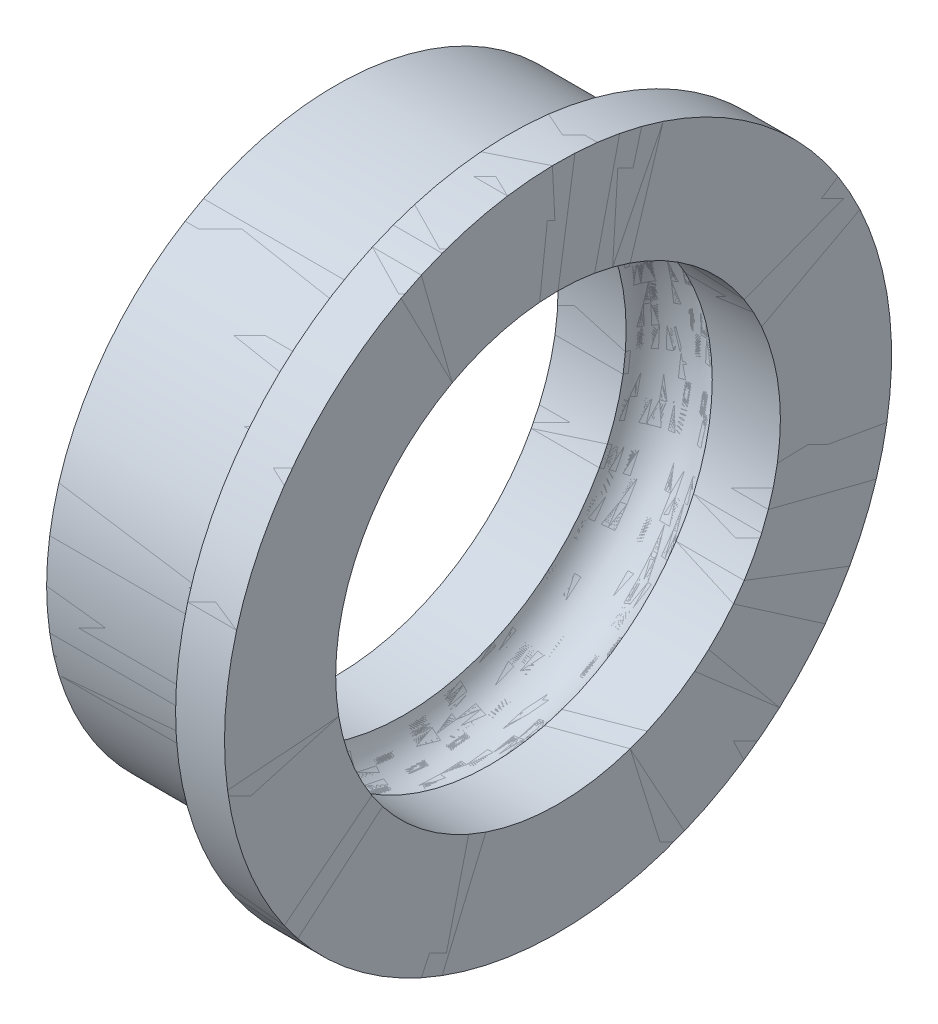
ISO-10303-21;
HEADER;
FILE_DESCRIPTION(('STEP AP214'),'2;1');
FILE_NAME('part.step','',(''),(''),'','','');
FILE_SCHEMA(('AUTOMOTIVE_DESIGN { 1 0 10303 214 1 1 1 1 }'));
ENDSEC;
DATA;
#1=APPLICATION_CONTEXT('core data for automotive mechanical design processes');
#2=APPLICATION_PROTOCOL_DEFINITION('international standard','automotive_design',2000,#1);
#3=PRODUCT_CONTEXT('',#1,'mechanical');
#4=PRODUCT('Part','Part','',(#3));
#5=PRODUCT_RELATED_PRODUCT_CATEGORY('part','',(#4));
#6=PRODUCT_DEFINITION_FORMATION('','',#4);
#7=PRODUCT_DEFINITION_CONTEXT('part definition',#1,'design');
#8=PRODUCT_DEFINITION('design','',#6,#7);
#9=PRODUCT_DEFINITION_SHAPE('','',#8);
#10=(LENGTH_UNIT() NAMED_UNIT(*) SI_UNIT(.MILLI.,.METRE.));
#11=(NAMED_UNIT(*) PLANE_ANGLE_UNIT() SI_UNIT($,.RADIAN.));
#12=(NAMED_UNIT(*) SI_UNIT($,.STERADIAN.) SOLID_ANGLE_UNIT());
#13=UNCERTAINTY_MEASURE_WITH_UNIT(LENGTH_MEASURE(1.E-05),#10,'distance_accuracy_value','');
#14=(GEOMETRIC_REPRESENTATION_CONTEXT(3) GLOBAL_UNCERTAINTY_ASSIGNED_CONTEXT((#13)) GLOBAL_UNIT_ASSIGNED_CONTEXT((#10,
#11,#12)) REPRESENTATION_CONTEXT('',''));
#15=CARTESIAN_POINT('',(0.,0.,0.));
#16=DIRECTION('',(0.,0.,1.));
#17=DIRECTION('',(1.,0.,0.));
#18=AXIS2_PLACEMENT_3D('',#15,#16,#17);
#19=CARTESIAN_POINT('',(-17.614667823321,-13.1096893901058,0.));
#20=DIRECTION('',(-1.,0.,0.));
#21=DIRECTION('',(0.,0.,1.));
#22=AXIS2_PLACEMENT_3D('',#19,#20,#21);
#23=TOROIDAL_SURFACE('',#22,4.75,1.);
#24=CARTESIAN_POINT('',(-18.5829136598729,-13.1096893901058,0.));
#25=DIRECTION('',(-1.,0.,0.));
#26=DIRECTION('',(0.,0.,1.));
#27=AXIS2_PLACEMENT_3D('',#24,#25,#26);
#28=CIRCLE('',#27,5.);
#29=CARTESIAN_POINT('',(-18.5829136598729,-13.1096893901058,5.));
#30=VERTEX_POINT('',#29);
#31=EDGE_CURVE('E67',#30,#30,#28,.T.);
#32=ORIENTED_EDGE('',*,*,#31,.T.);
#33=EDGE_LOOP('',(#32));
#34=FACE_BOUND('',#33,.T.);
#35=CARTESIAN_POINT('',(-16.6464219867692,-13.1096893901058,0.));
#36=DIRECTION('',(-1.,0.,0.));
#37=DIRECTION('',(0.,0.,1.));
#38=AXIS2_PLACEMENT_3D('',#35,#36,#37);
#39=CIRCLE('',#38,5.);
#40=CARTESIAN_POINT('',(-16.6464219867692,-13.1096893901058,5.));
#41=VERTEX_POINT('',#40);
#42=EDGE_CURVE('E11',#41,#41,#39,.T.);
#43=ORIENTED_EDGE('',*,*,#42,.F.);
#44=EDGE_LOOP('',(#43));
#45=FACE_BOUND('',#44,.T.);
#46=ADVANCED_FACE('F39',(#34,#45),#23,.F.);
#47=CARTESIAN_POINT('',(-17.614667823321,-13.1096893901058,0.));
#48=DIRECTION('',(-1.,0.,0.));
#49=DIRECTION('',(0.,0.,1.));
#50=AXIS2_PLACEMENT_3D('',#47,#48,#49);
#51=CYLINDRICAL_SURFACE('',#50,5.);
#52=ORIENTED_EDGE('',*,*,#42,.T.);
#53=EDGE_LOOP('',(#52));
#54=FACE_BOUND('',#53,.T.);
#55=CARTESIAN_POINT('',(-15.114667823321,-13.1096893901058,0.));
#56=DIRECTION('',(-1.,0.,0.));
#57=DIRECTION('',(0.,0.,1.));
#58=AXIS2_PLACEMENT_3D('',#55,#56,#57);
#59=CIRCLE('',#58,5.);
#60=CARTESIAN_POINT('',(-15.114667823321,-13.1096893901058,5.));
#61=VERTEX_POINT('',#60);
#62=EDGE_CURVE('E45',#61,#61,#59,.T.);
#63=ORIENTED_EDGE('',*,*,#62,.F.);
#64=EDGE_LOOP('',(#63));
#65=FACE_BOUND('',#64,.T.);
#66=ADVANCED_FACE('F85',(#54,#65),#51,.F.);
#67=CARTESIAN_POINT('',(-15.114667823321,-19.6096893901058,0.));
#68=DIRECTION('',(1.,0.,0.));
#69=DIRECTION('',(0.,0.,-1.));
#70=AXIS2_PLACEMENT_3D('',#67,#68,#69);
#71=PLANE('',#70);
#72=ORIENTED_EDGE('',*,*,#62,.T.);
#73=EDGE_LOOP('',(#72));
#74=FACE_BOUND('',#73,.T.);
#75=CARTESIAN_POINT('',(-15.114667823321,-13.1096893901058,0.));
#76=DIRECTION('',(-1.,0.,0.));
#77=DIRECTION('',(0.,0.,1.));
#78=AXIS2_PLACEMENT_3D('',#75,#76,#77);
#79=CIRCLE('',#78,7.5);
#80=CARTESIAN_POINT('',(-15.114667823321,-13.1096893901058,7.5));
#81=VERTEX_POINT('',#80);
#82=EDGE_CURVE('E49',#81,#81,#79,.T.);
#83=ORIENTED_EDGE('',*,*,#82,.F.);
#84=EDGE_LOOP('',(#83));
#85=FACE_BOUND('',#84,.T.);
#86=ADVANCED_FACE('F89',(#74,#85),#71,.T.);
#87=CARTESIAN_POINT('',(-17.614667823321,-13.1096893901058,0.));
#88=DIRECTION('',(-1.,0.,0.));
#89=DIRECTION('',(0.,0.,1.));
#90=AXIS2_PLACEMENT_3D('',#87,#88,#89);
#91=CYLINDRICAL_SURFACE('',#90,7.5);
#92=ORIENTED_EDGE('',*,*,#82,.T.);
#93=EDGE_LOOP('',(#92));
#94=FACE_BOUND('',#93,.T.);
#95=CARTESIAN_POINT('',(-16.214667823321,-13.1096893901058,0.));
#96=DIRECTION('',(-1.,0.,0.));
#97=DIRECTION('',(0.,0.,1.));
#98=AXIS2_PLACEMENT_3D('',#95,#96,#97);
#99=CIRCLE('',#98,7.5);
#100=CARTESIAN_POINT('',(-16.214667823321,-13.1096893901058,7.5));
#101=VERTEX_POINT('',#100);
#102=EDGE_CURVE('E53',#101,#101,#99,.T.);
#103=ORIENTED_EDGE('',*,*,#102,.F.);
#104=EDGE_LOOP('',(#103));
#105=FACE_BOUND('',#104,.T.);
#106=ADVANCED_FACE('F93',(#94,#105),#91,.T.);
#107=CARTESIAN_POINT('',(-16.214667823321,-20.6096893901058,0.));
#108=DIRECTION('',(-1.,0.,0.));
#109=DIRECTION('',(0.,0.,1.));
#110=AXIS2_PLACEMENT_3D('',#107,#108,#109);
#111=PLANE('',#110);
#112=ORIENTED_EDGE('',*,*,#102,.T.);
#113=EDGE_LOOP('',(#112));
#114=FACE_BOUND('',#113,.T.);
#115=CARTESIAN_POINT('',(-16.214667823321,-13.1096893901058,0.));
#116=DIRECTION('',(-1.,0.,0.));
#117=DIRECTION('',(0.,0.,1.));
#118=AXIS2_PLACEMENT_3D('',#115,#116,#117);
#119=CIRCLE('',#118,6.5);
#120=CARTESIAN_POINT('',(-16.214667823321,-13.1096893901058,6.5));
#121=VERTEX_POINT('',#120);
#122=EDGE_CURVE('E58',#121,#121,#119,.T.);
#123=ORIENTED_EDGE('',*,*,#122,.F.);
#124=EDGE_LOOP('',(#123));
#125=FACE_BOUND('',#124,.T.);
#126=ADVANCED_FACE('F99',(#114,#125),#111,.T.);
#127=CARTESIAN_POINT('',(-17.614667823321,-13.1096893901058,0.));
#128=DIRECTION('',(-1.,0.,0.));
#129=DIRECTION('',(0.,0.,1.));
#130=AXIS2_PLACEMENT_3D('',#127,#128,#129);
#131=CYLINDRICAL_SURFACE('',#130,6.5);
#132=ORIENTED_EDGE('',*,*,#122,.T.);
#133=EDGE_LOOP('',(#132));
#134=FACE_BOUND('',#133,.T.);
#135=CARTESIAN_POINT('',(-20.114667823321,-13.1096893901058,0.));
#136=DIRECTION('',(-1.,0.,0.));
#137=DIRECTION('',(0.,0.,1.));
#138=AXIS2_PLACEMENT_3D('',#135,#136,#137);
#139=CIRCLE('',#138,6.5);
#140=CARTESIAN_POINT('',(-20.114667823321,-13.1096893901058,6.5));
#141=VERTEX_POINT('',#140);
#142=EDGE_CURVE('E61',#141,#141,#139,.T.);
#143=ORIENTED_EDGE('',*,*,#142,.F.);
#144=EDGE_LOOP('',(#143));
#145=FACE_BOUND('',#144,.T.);
#146=ADVANCED_FACE('F81',(#134,#145),#131,.T.);
#147=CARTESIAN_POINT('',(-20.114667823321,-19.6096893901058,0.));
#148=DIRECTION('',(-1.,0.,0.));
#149=DIRECTION('',(0.,0.,1.));
#150=AXIS2_PLACEMENT_3D('',#147,#148,#149);
#151=PLANE('',#150);
#152=ORIENTED_EDGE('',*,*,#142,.T.);
#153=EDGE_LOOP('',(#152));
#154=FACE_BOUND('',#153,.T.);
#155=CARTESIAN_POINT('',(-20.114667823321,-13.1096893901058,0.));
#156=DIRECTION('',(-1.,0.,0.));
#157=DIRECTION('',(0.,0.,1.));
#158=AXIS2_PLACEMENT_3D('',#155,#156,#157);
#159=CIRCLE('',#158,5.);
#160=CARTESIAN_POINT('',(-20.114667823321,-13.1096893901058,5.));
#161=VERTEX_POINT('',#160);
#162=EDGE_CURVE('E64',#161,#161,#159,.T.);
#163=ORIENTED_EDGE('',*,*,#162,.F.);
#164=EDGE_LOOP('',(#163));
#165=FACE_BOUND('',#164,.T.);
#166=ADVANCED_FACE('F75',(#154,#165),#151,.T.);
#167=CARTESIAN_POINT('',(-17.614667823321,-13.1096893901058,0.));
#168=DIRECTION('',(-1.,0.,0.));
#169=DIRECTION('',(0.,0.,1.));
#170=AXIS2_PLACEMENT_3D('',#167,#168,#169);
#171=CYLINDRICAL_SURFACE('',#170,5.);
#172=ORIENTED_EDGE('',*,*,#162,.T.);
#173=EDGE_LOOP('',(#172));
#174=FACE_BOUND('',#173,.T.);
#175=ORIENTED_EDGE('',*,*,#31,.F.);
#176=EDGE_LOOP('',(#175));
#177=FACE_BOUND('',#176,.T.);
#178=ADVANCED_FACE('F73',(#174,#177),#171,.F.);
#179=CLOSED_SHELL('',(#46,#66,#86,#106,#126,#146,#166,#178));
#180=MANIFOLD_SOLID_BREP('B2',#179);
#181=CARTESIAN_POINT('',(-20.114667823321,-6.60968939010578,0.));
#182=DIRECTION('',(1.,0.,0.));
#183=DIRECTION('',(0.,0.,-1.));
#184=AXIS2_PLACEMENT_3D('',#181,#182,#183);
#185=PLANE('',#184);
#186=CARTESIAN_POINT('',(-20.114667823321,-13.1096893901058,0.));
#187=DIRECTION('',(-1.,0.,0.));
#188=DIRECTION('',(0.,0.,1.));
#189=AXIS2_PLACEMENT_3D('',#186,#187,#188);
#190=CIRCLE('',#189,5.);
#191=CARTESIAN_POINT('',(-20.114667823321,-13.1096893901058,5.));
#192=VERTEX_POINT('',#191);
#193=EDGE_CURVE('E38',#192,#192,#190,.T.);
#194=ORIENTED_EDGE('',*,*,#193,.F.);
#195=EDGE_LOOP('',(#194));
#196=FACE_BOUND('',#195,.T.);
#197=CARTESIAN_POINT('',(-20.114667823321,-13.1096893901058,0.));
#198=DIRECTION('',(-1.,0.,0.));
#199=DIRECTION('',(0.,0.,1.));
#200=AXIS2_PLACEMENT_3D('',#197,#198,#199);
#201=CIRCLE('',#200,6.5);
#202=CARTESIAN_POINT('',(-20.114667823321,-13.1096893901058,6.5));
#203=VERTEX_POINT('',#202);
#204=EDGE_CURVE('E192',#203,#203,#201,.T.);
#205=ORIENTED_EDGE('',*,*,#204,.T.);
#206=EDGE_LOOP('',(#205));
#207=FACE_BOUND('',#206,.T.);
#208=ADVANCED_FACE('F164',(#196,#207),#185,.F.);
#209=CARTESIAN_POINT('',(-17.614667823321,-13.1096893901058,0.));
#210=DIRECTION('',(-1.,0.,0.));
#211=DIRECTION('',(0.,0.,1.));
#212=AXIS2_PLACEMENT_3D('',#209,#210,#211);
#213=CYLINDRICAL_SURFACE('',#212,5.);
#214=CARTESIAN_POINT('',(-18.5829136598729,-13.1096893901058,0.));
#215=DIRECTION('',(-1.,0.,0.));
#216=DIRECTION('',(0.,0.,1.));
#217=AXIS2_PLACEMENT_3D('',#214,#215,#216);
#218=CIRCLE('',#217,5.);
#219=CARTESIAN_POINT('',(-18.5829136598729,-13.1096893901058,5.));
#220=VERTEX_POINT('',#219);
#221=EDGE_CURVE('E170',#220,#220,#218,.T.);
#222=ORIENTED_EDGE('',*,*,#221,.F.);
#223=EDGE_LOOP('',(#222));
#224=FACE_BOUND('',#223,.T.);
#225=ORIENTED_EDGE('',*,*,#193,.T.);
#226=EDGE_LOOP('',(#225));
#227=FACE_BOUND('',#226,.T.);
#228=ADVANCED_FACE('F229',(#224,#227),#213,.F.);
#229=CARTESIAN_POINT('',(-17.614667823321,-13.1096893901058,0.));
#230=DIRECTION('',(-1.,0.,0.));
#231=DIRECTION('',(0.,0.,1.));
#232=AXIS2_PLACEMENT_3D('',#229,#230,#231);
#233=TOROIDAL_SURFACE('',#232,4.75,1.);
#234=CARTESIAN_POINT('',(-16.6464219867692,-13.1096893901058,0.));
#235=DIRECTION('',(-1.,0.,0.));
#236=DIRECTION('',(0.,0.,1.));
#237=AXIS2_PLACEMENT_3D('',#234,#235,#236);
#238=CIRCLE('',#237,5.);
#239=CARTESIAN_POINT('',(-16.6464219867692,-13.1096893901058,5.));
#240=VERTEX_POINT('',#239);
#241=EDGE_CURVE('E174',#240,#240,#238,.T.);
#242=ORIENTED_EDGE('',*,*,#241,.F.);
#243=EDGE_LOOP('',(#242));
#244=FACE_BOUND('',#243,.T.);
#245=ORIENTED_EDGE('',*,*,#221,.T.);
#246=EDGE_LOOP('',(#245));
#247=FACE_BOUND('',#246,.T.);
#248=ADVANCED_FACE('F224',(#244,#247),#233,.F.);
#249=CARTESIAN_POINT('',(-17.614667823321,-13.1096893901058,0.));
#250=DIRECTION('',(-1.,0.,0.));
#251=DIRECTION('',(0.,0.,1.));
#252=AXIS2_PLACEMENT_3D('',#249,#250,#251);
#253=CYLINDRICAL_SURFACE('',#252,5.);
#254=CARTESIAN_POINT('',(-15.114667823321,-13.1096893901058,0.));
#255=DIRECTION('',(-1.,0.,0.));
#256=DIRECTION('',(0.,0.,1.));
#257=AXIS2_PLACEMENT_3D('',#254,#255,#256);
#258=CIRCLE('',#257,5.);
#259=CARTESIAN_POINT('',(-15.114667823321,-13.1096893901058,5.));
#260=VERTEX_POINT('',#259);
#261=EDGE_CURVE('E178',#260,#260,#258,.T.);
#262=ORIENTED_EDGE('',*,*,#261,.F.);
#263=EDGE_LOOP('',(#262));
#264=FACE_BOUND('',#263,.T.);
#265=ORIENTED_EDGE('',*,*,#241,.T.);
#266=EDGE_LOOP('',(#265));
#267=FACE_BOUND('',#266,.T.);
#268=ADVANCED_FACE('F218',(#264,#267),#253,.F.);
#269=CARTESIAN_POINT('',(-15.114667823321,-6.60968939010578,0.));
#270=DIRECTION('',(-1.,0.,0.));
#271=DIRECTION('',(0.,0.,1.));
#272=AXIS2_PLACEMENT_3D('',#269,#270,#271);
#273=PLANE('',#272);
#274=CARTESIAN_POINT('',(-15.114667823321,-13.1096893901058,0.));
#275=DIRECTION('',(-1.,0.,0.));
#276=DIRECTION('',(0.,0.,1.));
#277=AXIS2_PLACEMENT_3D('',#274,#275,#276);
#278=CIRCLE('',#277,7.5);
#279=CARTESIAN_POINT('',(-15.114667823321,-13.1096893901058,7.5));
#280=VERTEX_POINT('',#279);
#281=EDGE_CURVE('E183',#280,#280,#278,.T.);
#282=ORIENTED_EDGE('',*,*,#281,.F.);
#283=EDGE_LOOP('',(#282));
#284=FACE_BOUND('',#283,.T.);
#285=ORIENTED_EDGE('',*,*,#261,.T.);
#286=EDGE_LOOP('',(#285));
#287=FACE_BOUND('',#286,.T.);
#288=ADVANCED_FACE('F212',(#284,#287),#273,.F.);
#289=CARTESIAN_POINT('',(-17.614667823321,-13.1096893901058,0.));
#290=DIRECTION('',(-1.,0.,0.));
#291=DIRECTION('',(0.,0.,1.));
#292=AXIS2_PLACEMENT_3D('',#289,#290,#291);
#293=CYLINDRICAL_SURFACE('',#292,7.5);
#294=CARTESIAN_POINT('',(-16.214667823321,-13.1096893901058,0.));
#295=DIRECTION('',(-1.,0.,0.));
#296=DIRECTION('',(0.,0.,1.));
#297=AXIS2_PLACEMENT_3D('',#294,#295,#296);
#298=CIRCLE('',#297,7.5);
#299=CARTESIAN_POINT('',(-16.214667823321,-13.1096893901058,7.5));
#300=VERTEX_POINT('',#299);
#301=EDGE_CURVE('E186',#300,#300,#298,.T.);
#302=ORIENTED_EDGE('',*,*,#301,.F.);
#303=EDGE_LOOP('',(#302));
#304=FACE_BOUND('',#303,.T.);
#305=ORIENTED_EDGE('',*,*,#281,.T.);
#306=EDGE_LOOP('',(#305));
#307=FACE_BOUND('',#306,.T.);
#308=ADVANCED_FACE('F206',(#304,#307),#293,.T.);
#309=CARTESIAN_POINT('',(-16.214667823321,-5.60968939010578,0.));
#310=DIRECTION('',(1.,0.,0.));
#311=DIRECTION('',(0.,0.,-1.));
#312=AXIS2_PLACEMENT_3D('',#309,#310,#311);
#313=PLANE('',#312);
#314=CARTESIAN_POINT('',(-16.214667823321,-13.1096893901058,0.));
#315=DIRECTION('',(-1.,0.,0.));
#316=DIRECTION('',(0.,0.,1.));
#317=AXIS2_PLACEMENT_3D('',#314,#315,#316);
#318=CIRCLE('',#317,6.5);
#319=CARTESIAN_POINT('',(-16.214667823321,-13.1096893901058,6.5));
#320=VERTEX_POINT('',#319);
#321=EDGE_CURVE('E189',#320,#320,#318,.T.);
#322=ORIENTED_EDGE('',*,*,#321,.F.);
#323=EDGE_LOOP('',(#322));
#324=FACE_BOUND('',#323,.T.);
#325=ORIENTED_EDGE('',*,*,#301,.T.);
#326=EDGE_LOOP('',(#325));
#327=FACE_BOUND('',#326,.T.);
#328=ADVANCED_FACE('F200',(#324,#327),#313,.F.);
#329=CARTESIAN_POINT('',(-17.614667823321,-13.1096893901058,0.));
#330=DIRECTION('',(-1.,0.,0.));
#331=DIRECTION('',(0.,0.,1.));
#332=AXIS2_PLACEMENT_3D('',#329,#330,#331);
#333=CYLINDRICAL_SURFACE('',#332,6.5);
#334=ORIENTED_EDGE('',*,*,#204,.F.);
#335=EDGE_LOOP('',(#334));
#336=FACE_BOUND('',#335,.T.);
#337=ORIENTED_EDGE('',*,*,#321,.T.);
#338=EDGE_LOOP('',(#337));
#339=FACE_BOUND('',#338,.T.);
#340=ADVANCED_FACE('F197',(#336,#339),#333,.T.);
#341=CLOSED_SHELL('',(#208,#228,#248,#268,#288,#308,#328,#340));
#342=MANIFOLD_SOLID_BREP('B6',#341);
#343=ADVANCED_BREP_SHAPE_REPRESENTATION('',(#18,#180,#342),#14);
#344=SHAPE_DEFINITION_REPRESENTATION(#9,#343);
ENDSEC;
END-ISO-10303-21;
